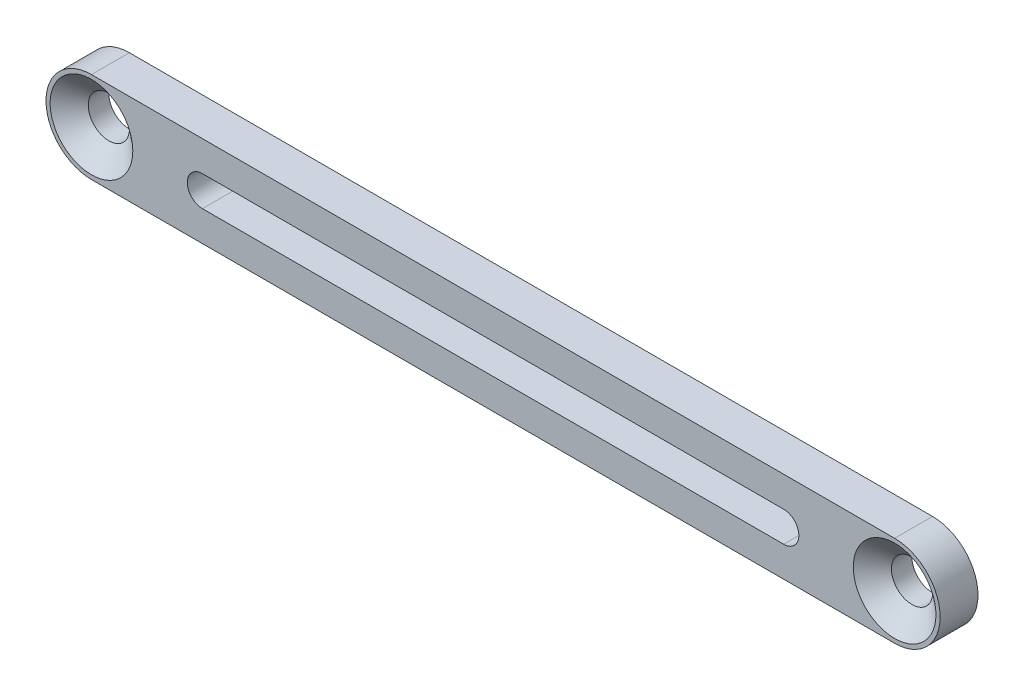
ISO-10303-21;
HEADER;
FILE_DESCRIPTION(('STEP AP214'),'2;1');
FILE_NAME('part.step','',(''),(''),'','','');
FILE_SCHEMA(('AUTOMOTIVE_DESIGN { 1 0 10303 214 1 1 1 1 }'));
ENDSEC;
DATA;
#1=APPLICATION_CONTEXT('core data for automotive mechanical design processes');
#2=APPLICATION_PROTOCOL_DEFINITION('international standard','automotive_design',2000,#1);
#3=PRODUCT_CONTEXT('',#1,'mechanical');
#4=PRODUCT('Part','Part','',(#3));
#5=PRODUCT_RELATED_PRODUCT_CATEGORY('part','',(#4));
#6=PRODUCT_DEFINITION_FORMATION('','',#4);
#7=PRODUCT_DEFINITION_CONTEXT('part definition',#1,'design');
#8=PRODUCT_DEFINITION('design','',#6,#7);
#9=PRODUCT_DEFINITION_SHAPE('','',#8);
#10=(LENGTH_UNIT() NAMED_UNIT(*) SI_UNIT(.MILLI.,.METRE.));
#11=(NAMED_UNIT(*) PLANE_ANGLE_UNIT() SI_UNIT($,.RADIAN.));
#12=(NAMED_UNIT(*) SI_UNIT($,.STERADIAN.) SOLID_ANGLE_UNIT());
#13=UNCERTAINTY_MEASURE_WITH_UNIT(LENGTH_MEASURE(1.E-05),#10,'distance_accuracy_value','');
#14=(GEOMETRIC_REPRESENTATION_CONTEXT(3) GLOBAL_UNCERTAINTY_ASSIGNED_CONTEXT((#13)) GLOBAL_UNIT_ASSIGNED_CONTEXT((#10,
#11,#12)) REPRESENTATION_CONTEXT('',''));
#15=CARTESIAN_POINT('',(0.,0.,0.));
#16=DIRECTION('',(0.,0.,1.));
#17=DIRECTION('',(1.,0.,0.));
#18=AXIS2_PLACEMENT_3D('',#15,#16,#17);
#19=CARTESIAN_POINT('',(5.46957111634242,20.4127173018017,3.175));
#20=DIRECTION('',(0.,0.,-1.));
#21=DIRECTION('',(-1.,0.,0.));
#22=AXIS2_PLACEMENT_3D('',#19,#20,#21);
#23=CYLINDRICAL_SURFACE('',#22,3.81);
#24=CARTESIAN_POINT('',(5.46957111634242,20.4127173018017,0.));
#25=DIRECTION('',(0.,0.,1.));
#26=DIRECTION('',(-1.,0.,0.));
#27=AXIS2_PLACEMENT_3D('',#24,#25,#26);
#28=CIRCLE('',#27,3.81);
#29=CARTESIAN_POINT('',(5.46957111634242,24.2227173018017,0.));
#30=VERTEX_POINT('',#29);
#31=CARTESIAN_POINT('',(5.46957111634242,16.6027173018017,0.));
#32=VERTEX_POINT('',#31);
#33=EDGE_CURVE('E150',#30,#32,#28,.T.);
#34=ORIENTED_EDGE('',*,*,#33,.T.);
#35=DIRECTION('',(0.,0.,-1.));
#36=VECTOR('',#35,1.);
#37=CARTESIAN_POINT('',(5.46957111634242,16.6027173018017,3.175));
#38=LINE('',#37,#36);
#39=CARTESIAN_POINT('',(5.46957111634242,16.6027173018017,3.175));
#40=VERTEX_POINT('',#39);
#41=EDGE_CURVE('E11',#40,#32,#38,.T.);
#42=ORIENTED_EDGE('',*,*,#41,.F.);
#43=CARTESIAN_POINT('',(5.46957111634242,20.4127173018017,3.175));
#44=DIRECTION('',(0.,0.,1.));
#45=DIRECTION('',(-1.,0.,0.));
#46=AXIS2_PLACEMENT_3D('',#43,#44,#45);
#47=CIRCLE('',#46,3.81);
#48=CARTESIAN_POINT('',(5.46957111634242,24.2227173018017,3.175));
#49=VERTEX_POINT('',#48);
#50=EDGE_CURVE('E151',#49,#40,#47,.T.);
#51=ORIENTED_EDGE('',*,*,#50,.F.);
#52=DIRECTION('',(0.,0.,-1.));
#53=VECTOR('',#52,1.);
#54=CARTESIAN_POINT('',(5.46957111634242,24.2227173018017,3.175));
#55=LINE('',#54,#53);
#56=EDGE_CURVE('E161',#49,#30,#55,.T.);
#57=ORIENTED_EDGE('',*,*,#56,.T.);
#58=EDGE_LOOP('',(#34,#42,#51,#57));
#59=FACE_BOUND('',#58,.T.);
#60=ADVANCED_FACE('F32',(#59),#23,.T.);
#61=CARTESIAN_POINT('',(5.46957111634242,16.6027173018017,3.175));
#62=DIRECTION('',(0.,1.,0.));
#63=DIRECTION('',(0.,0.,1.));
#64=AXIS2_PLACEMENT_3D('',#61,#62,#63);
#65=PLANE('',#64);
#66=DIRECTION('',(1.,0.,0.));
#67=VECTOR('',#66,1.);
#68=CARTESIAN_POINT('',(5.46957111634242,16.6027173018017,0.));
#69=LINE('',#68,#67);
#70=CARTESIAN_POINT('',(72.7691578096297,16.6027173018017,0.));
#71=VERTEX_POINT('',#70);
#72=EDGE_CURVE('E164',#32,#71,#69,.T.);
#73=ORIENTED_EDGE('',*,*,#72,.T.);
#74=DIRECTION('',(0.,0.,-1.));
#75=VECTOR('',#74,1.);
#76=CARTESIAN_POINT('',(72.7691578096297,16.6027173018017,3.175));
#77=LINE('',#76,#75);
#78=CARTESIAN_POINT('',(72.7691578096297,16.6027173018017,3.175));
#79=VERTEX_POINT('',#78);
#80=EDGE_CURVE('E39',#79,#71,#77,.T.);
#81=ORIENTED_EDGE('',*,*,#80,.F.);
#82=DIRECTION('',(1.,0.,0.));
#83=VECTOR('',#82,1.);
#84=CARTESIAN_POINT('',(5.46957111634242,16.6027173018017,3.175));
#85=LINE('',#84,#83);
#86=EDGE_CURVE('E154',#40,#79,#85,.T.);
#87=ORIENTED_EDGE('',*,*,#86,.F.);
#88=ORIENTED_EDGE('',*,*,#41,.T.);
#89=EDGE_LOOP('',(#73,#81,#87,#88));
#90=FACE_BOUND('',#89,.T.);
#91=ADVANCED_FACE('F193',(#90),#65,.F.);
#92=CARTESIAN_POINT('',(72.7691578096297,20.4127173018016,3.175));
#93=DIRECTION('',(0.,0.,-1.));
#94=DIRECTION('',(-1.,0.,0.));
#95=AXIS2_PLACEMENT_3D('',#92,#93,#94);
#96=CYLINDRICAL_SURFACE('',#95,3.81);
#97=CARTESIAN_POINT('',(72.7691578096297,20.4127173018016,0.));
#98=DIRECTION('',(0.,0.,1.));
#99=DIRECTION('',(1.,0.,0.));
#100=AXIS2_PLACEMENT_3D('',#97,#98,#99);
#101=CIRCLE('',#100,3.81);
#102=CARTESIAN_POINT('',(72.7691578096297,24.2227173018016,0.));
#103=VERTEX_POINT('',#102);
#104=EDGE_CURVE('E166',#71,#103,#101,.T.);
#105=ORIENTED_EDGE('',*,*,#104,.T.);
#106=DIRECTION('',(0.,0.,-1.));
#107=VECTOR('',#106,1.);
#108=CARTESIAN_POINT('',(72.7691578096297,24.2227173018016,3.175));
#109=LINE('',#108,#107);
#110=CARTESIAN_POINT('',(72.7691578096297,24.2227173018016,3.175));
#111=VERTEX_POINT('',#110);
#112=EDGE_CURVE('E171',#111,#103,#109,.T.);
#113=ORIENTED_EDGE('',*,*,#112,.F.);
#114=CARTESIAN_POINT('',(72.7691578096297,20.4127173018016,3.175));
#115=DIRECTION('',(0.,0.,1.));
#116=DIRECTION('',(1.,0.,0.));
#117=AXIS2_PLACEMENT_3D('',#114,#115,#116);
#118=CIRCLE('',#117,3.81);
#119=EDGE_CURVE('E157',#79,#111,#118,.T.);
#120=ORIENTED_EDGE('',*,*,#119,.F.);
#121=ORIENTED_EDGE('',*,*,#80,.T.);
#122=EDGE_LOOP('',(#105,#113,#120,#121));
#123=FACE_BOUND('',#122,.T.);
#124=ADVANCED_FACE('F178',(#123),#96,.T.);
#125=CARTESIAN_POINT('',(5.46957111634242,24.2227173018017,3.175));
#126=DIRECTION('',(0.,-1.,0.));
#127=DIRECTION('',(0.,0.,-1.));
#128=AXIS2_PLACEMENT_3D('',#125,#126,#127);
#129=PLANE('',#128);
#130=DIRECTION('',(-1.,0.,0.));
#131=VECTOR('',#130,1.);
#132=CARTESIAN_POINT('',(5.46957111634242,24.2227173018017,0.));
#133=LINE('',#132,#131);
#134=EDGE_CURVE('E155',#103,#30,#133,.T.);
#135=ORIENTED_EDGE('',*,*,#134,.T.);
#136=ORIENTED_EDGE('',*,*,#56,.F.);
#137=DIRECTION('',(-1.,0.,0.));
#138=VECTOR('',#137,1.);
#139=CARTESIAN_POINT('',(5.46957111634242,24.2227173018017,3.175));
#140=LINE('',#139,#138);
#141=EDGE_CURVE('E159',#111,#49,#140,.T.);
#142=ORIENTED_EDGE('',*,*,#141,.F.);
#143=ORIENTED_EDGE('',*,*,#112,.T.);
#144=EDGE_LOOP('',(#135,#136,#142,#143));
#145=FACE_BOUND('',#144,.T.);
#146=ADVANCED_FACE('F187',(#145),#129,.F.);
#147=CARTESIAN_POINT('',(5.46957111634242,20.4127173018017,3.175));
#148=DIRECTION('',(0.,0.,-1.));
#149=DIRECTION('',(-1.,0.,0.));
#150=AXIS2_PLACEMENT_3D('',#147,#148,#149);
#151=PLANE('',#150);
#152=DIRECTION('',(1.,0.,0.));
#153=VECTOR('',#152,1.);
#154=CARTESIAN_POINT('',(63.4727578096297,21.6827173018017,3.175));
#155=LINE('',#154,#153);
#156=CARTESIAN_POINT('',(14.7659711163424,21.6827173018017,3.175));
#157=VERTEX_POINT('',#156);
#158=CARTESIAN_POINT('',(63.4727578096297,21.6827173018017,3.175));
#159=VERTEX_POINT('',#158);
#160=EDGE_CURVE('E104',#157,#159,#155,.T.);
#161=ORIENTED_EDGE('',*,*,#160,.T.);
#162=CARTESIAN_POINT('',(63.4727578096297,20.4127173018016,3.175));
#163=DIRECTION('',(0.,0.,-1.));
#164=DIRECTION('',(-1.,0.,0.));
#165=AXIS2_PLACEMENT_3D('',#162,#163,#164);
#166=CIRCLE('',#165,1.27);
#167=CARTESIAN_POINT('',(63.4727578096297,19.1427173018017,3.175));
#168=VERTEX_POINT('',#167);
#169=EDGE_CURVE('E98',#159,#168,#166,.T.);
#170=ORIENTED_EDGE('',*,*,#169,.T.);
#171=DIRECTION('',(-1.,0.,0.));
#172=VECTOR('',#171,1.);
#173=CARTESIAN_POINT('',(63.4727578096297,19.1427173018017,3.175));
#174=LINE('',#173,#172);
#175=CARTESIAN_POINT('',(14.7659711163424,19.1427173018017,3.175));
#176=VERTEX_POINT('',#175);
#177=EDGE_CURVE('E107',#168,#176,#174,.T.);
#178=ORIENTED_EDGE('',*,*,#177,.T.);
#179=CARTESIAN_POINT('',(14.7659711163424,20.4127173018017,3.175));
#180=DIRECTION('',(0.,0.,-1.));
#181=DIRECTION('',(-1.,0.,0.));
#182=AXIS2_PLACEMENT_3D('',#179,#180,#181);
#183=CIRCLE('',#182,1.27);
#184=EDGE_CURVE('E46',#176,#157,#183,.T.);
#185=ORIENTED_EDGE('',*,*,#184,.T.);
#186=EDGE_LOOP('',(#161,#170,#178,#185));
#187=FACE_BOUND('',#186,.T.);
#188=CARTESIAN_POINT('',(5.46957111634242,20.4127173018017,3.175));
#189=DIRECTION('',(0.,0.,1.));
#190=DIRECTION('',(1.,0.,0.));
#191=AXIS2_PLACEMENT_3D('',#188,#189,#190);
#192=CIRCLE('',#191,3.462909);
#193=CARTESIAN_POINT('',(8.93248011634242,20.4127173018017,3.175));
#194=VERTEX_POINT('',#193);
#195=EDGE_CURVE('E129',#194,#194,#192,.T.);
#196=ORIENTED_EDGE('',*,*,#195,.F.);
#197=EDGE_LOOP('',(#196));
#198=FACE_BOUND('',#197,.T.);
#199=CARTESIAN_POINT('',(72.7691578096297,20.4127173018016,3.175));
#200=DIRECTION('',(0.,0.,1.));
#201=DIRECTION('',(1.,0.,0.));
#202=AXIS2_PLACEMENT_3D('',#199,#200,#201);
#203=CIRCLE('',#202,3.462909);
#204=CARTESIAN_POINT('',(76.2320668096297,20.4127173018016,3.175));
#205=VERTEX_POINT('',#204);
#206=EDGE_CURVE('E141',#205,#205,#203,.T.);
#207=ORIENTED_EDGE('',*,*,#206,.F.);
#208=EDGE_LOOP('',(#207));
#209=FACE_BOUND('',#208,.T.);
#210=ORIENTED_EDGE('',*,*,#50,.T.);
#211=ORIENTED_EDGE('',*,*,#86,.T.);
#212=ORIENTED_EDGE('',*,*,#119,.T.);
#213=ORIENTED_EDGE('',*,*,#141,.T.);
#214=EDGE_LOOP('',(#210,#211,#212,#213));
#215=FACE_BOUND('',#214,.T.);
#216=ADVANCED_FACE('F111',(#187,#198,#209,#215),#151,.F.);
#217=CARTESIAN_POINT('',(5.46957111634242,20.4127173018017,0.));
#218=DIRECTION('',(0.,0.,-1.));
#219=DIRECTION('',(-1.,0.,0.));
#220=AXIS2_PLACEMENT_3D('',#217,#218,#219);
#221=PLANE('',#220);
#222=CARTESIAN_POINT('',(63.4727578096297,20.4127173018016,0.));
#223=DIRECTION('',(0.,0.,-1.));
#224=DIRECTION('',(-1.,0.,0.));
#225=AXIS2_PLACEMENT_3D('',#222,#223,#224);
#226=CIRCLE('',#225,1.27);
#227=CARTESIAN_POINT('',(63.4727578096297,21.6827173018017,0.));
#228=VERTEX_POINT('',#227);
#229=CARTESIAN_POINT('',(63.4727578096297,19.1427173018017,0.));
#230=VERTEX_POINT('',#229);
#231=EDGE_CURVE('E54',#228,#230,#226,.T.);
#232=ORIENTED_EDGE('',*,*,#231,.F.);
#233=DIRECTION('',(1.,0.,0.));
#234=VECTOR('',#233,1.);
#235=CARTESIAN_POINT('',(63.4727578096297,21.6827173018017,0.));
#236=LINE('',#235,#234);
#237=CARTESIAN_POINT('',(14.7659711163424,21.6827173018017,0.));
#238=VERTEX_POINT('',#237);
#239=EDGE_CURVE('E114',#238,#228,#236,.T.);
#240=ORIENTED_EDGE('',*,*,#239,.F.);
#241=CARTESIAN_POINT('',(14.7659711163424,20.4127173018017,0.));
#242=DIRECTION('',(0.,0.,-1.));
#243=DIRECTION('',(-1.,0.,0.));
#244=AXIS2_PLACEMENT_3D('',#241,#242,#243);
#245=CIRCLE('',#244,1.27);
#246=CARTESIAN_POINT('',(14.7659711163424,19.1427173018017,0.));
#247=VERTEX_POINT('',#246);
#248=EDGE_CURVE('E117',#247,#238,#245,.T.);
#249=ORIENTED_EDGE('',*,*,#248,.F.);
#250=DIRECTION('',(-1.,0.,0.));
#251=VECTOR('',#250,1.);
#252=CARTESIAN_POINT('',(63.4727578096297,19.1427173018017,0.));
#253=LINE('',#252,#251);
#254=EDGE_CURVE('E123',#230,#247,#253,.T.);
#255=ORIENTED_EDGE('',*,*,#254,.F.);
#256=EDGE_LOOP('',(#232,#240,#249,#255));
#257=FACE_BOUND('',#256,.T.);
#258=CARTESIAN_POINT('',(5.46957111634242,20.4127173018017,0.));
#259=DIRECTION('',(0.,0.,1.));
#260=DIRECTION('',(1.,0.,0.));
#261=AXIS2_PLACEMENT_3D('',#258,#259,#260);
#262=CIRCLE('',#261,1.7272);
#263=CARTESIAN_POINT('',(7.19677111634242,20.4127173018017,0.));
#264=VERTEX_POINT('',#263);
#265=EDGE_CURVE('E138',#264,#264,#262,.T.);
#266=ORIENTED_EDGE('',*,*,#265,.T.);
#267=EDGE_LOOP('',(#266));
#268=FACE_BOUND('',#267,.T.);
#269=CARTESIAN_POINT('',(72.7691578096297,20.4127173018016,0.));
#270=DIRECTION('',(0.,0.,1.));
#271=DIRECTION('',(1.,0.,0.));
#272=AXIS2_PLACEMENT_3D('',#269,#270,#271);
#273=CIRCLE('',#272,1.7272);
#274=CARTESIAN_POINT('',(74.4963578096297,20.4127173018016,0.));
#275=VERTEX_POINT('',#274);
#276=EDGE_CURVE('E147',#275,#275,#273,.T.);
#277=ORIENTED_EDGE('',*,*,#276,.T.);
#278=EDGE_LOOP('',(#277));
#279=FACE_BOUND('',#278,.T.);
#280=ORIENTED_EDGE('',*,*,#33,.F.);
#281=ORIENTED_EDGE('',*,*,#134,.F.);
#282=ORIENTED_EDGE('',*,*,#104,.F.);
#283=ORIENTED_EDGE('',*,*,#72,.F.);
#284=EDGE_LOOP('',(#280,#281,#282,#283));
#285=FACE_BOUND('',#284,.T.);
#286=ADVANCED_FACE('F184',(#257,#268,#279,#285),#221,.T.);
#287=CARTESIAN_POINT('',(72.7691578096297,20.4127173018016,3.175));
#288=DIRECTION('',(0.,0.,1.));
#289=DIRECTION('',(1.,0.,0.));
#290=AXIS2_PLACEMENT_3D('',#287,#288,#289);
#291=CYLINDRICAL_SURFACE('',#290,1.7272);
#292=ORIENTED_EDGE('',*,*,#276,.F.);
#293=EDGE_LOOP('',(#292));
#294=FACE_BOUND('',#293,.T.);
#295=CARTESIAN_POINT('',(72.7691578096297,20.4127173018016,1.71856721826891));
#296=DIRECTION('',(0.,0.,1.));
#297=DIRECTION('',(1.,0.,0.));
#298=AXIS2_PLACEMENT_3D('',#295,#296,#297);
#299=CIRCLE('',#298,1.7272);
#300=CARTESIAN_POINT('',(74.4963578096297,20.4127173018016,1.71856721826891));
#301=VERTEX_POINT('',#300);
#302=EDGE_CURVE('E144',#301,#301,#299,.T.);
#303=ORIENTED_EDGE('',*,*,#302,.T.);
#304=EDGE_LOOP('',(#303));
#305=FACE_BOUND('',#304,.T.);
#306=ADVANCED_FACE('F205',(#294,#305),#291,.F.);
#307=CARTESIAN_POINT('',(72.7691578096297,20.4127173018016,3.175));
#308=DIRECTION('',(0.,0.,1.));
#309=DIRECTION('',(1.,0.,0.));
#310=AXIS2_PLACEMENT_3D('',#307,#308,#309);
#311=CONICAL_SURFACE('',#310,3.462909,0.872664625997165);
#312=ORIENTED_EDGE('',*,*,#302,.F.);
#313=EDGE_LOOP('',(#312));
#314=FACE_BOUND('',#313,.T.);
#315=ORIENTED_EDGE('',*,*,#206,.T.);
#316=EDGE_LOOP('',(#315));
#317=FACE_BOUND('',#316,.T.);
#318=ADVANCED_FACE('F211',(#314,#317),#311,.F.);
#319=CARTESIAN_POINT('',(5.46957111634242,20.4127173018017,3.175));
#320=DIRECTION('',(0.,0.,1.));
#321=DIRECTION('',(1.,0.,0.));
#322=AXIS2_PLACEMENT_3D('',#319,#320,#321);
#323=CYLINDRICAL_SURFACE('',#322,1.7272);
#324=ORIENTED_EDGE('',*,*,#265,.F.);
#325=EDGE_LOOP('',(#324));
#326=FACE_BOUND('',#325,.T.);
#327=CARTESIAN_POINT('',(5.46957111634242,20.4127173018017,1.71856721826891));
#328=DIRECTION('',(0.,0.,1.));
#329=DIRECTION('',(1.,0.,0.));
#330=AXIS2_PLACEMENT_3D('',#327,#328,#329);
#331=CIRCLE('',#330,1.7272);
#332=CARTESIAN_POINT('',(7.19677111634242,20.4127173018017,1.71856721826891));
#333=VERTEX_POINT('',#332);
#334=EDGE_CURVE('E135',#333,#333,#331,.T.);
#335=ORIENTED_EDGE('',*,*,#334,.T.);
#336=EDGE_LOOP('',(#335));
#337=FACE_BOUND('',#336,.T.);
#338=ADVANCED_FACE('F215',(#326,#337),#323,.F.);
#339=CARTESIAN_POINT('',(5.46957111634242,20.4127173018017,3.175));
#340=DIRECTION('',(0.,0.,1.));
#341=DIRECTION('',(1.,0.,0.));
#342=AXIS2_PLACEMENT_3D('',#339,#340,#341);
#343=CONICAL_SURFACE('',#342,3.462909,0.872664625997164);
#344=ORIENTED_EDGE('',*,*,#334,.F.);
#345=EDGE_LOOP('',(#344));
#346=FACE_BOUND('',#345,.T.);
#347=ORIENTED_EDGE('',*,*,#195,.T.);
#348=EDGE_LOOP('',(#347));
#349=FACE_BOUND('',#348,.T.);
#350=ADVANCED_FACE('F219',(#346,#349),#343,.F.);
#351=CARTESIAN_POINT('',(63.4727578096297,20.4127173018016,3.175));
#352=DIRECTION('',(0.,0.,-1.));
#353=DIRECTION('',(-1.,0.,0.));
#354=AXIS2_PLACEMENT_3D('',#351,#352,#353);
#355=CYLINDRICAL_SURFACE('',#354,1.27);
#356=ORIENTED_EDGE('',*,*,#231,.T.);
#357=DIRECTION('',(0.,0.,-1.));
#358=VECTOR('',#357,1.);
#359=CARTESIAN_POINT('',(63.4727578096297,19.1427173018017,3.175));
#360=LINE('',#359,#358);
#361=EDGE_CURVE('E94',#168,#230,#360,.T.);
#362=ORIENTED_EDGE('',*,*,#361,.F.);
#363=ORIENTED_EDGE('',*,*,#169,.F.);
#364=DIRECTION('',(0.,0.,-1.));
#365=VECTOR('',#364,1.);
#366=CARTESIAN_POINT('',(63.4727578096297,21.6827173018017,3.175));
#367=LINE('',#366,#365);
#368=EDGE_CURVE('E127',#159,#228,#367,.T.);
#369=ORIENTED_EDGE('',*,*,#368,.T.);
#370=EDGE_LOOP('',(#356,#362,#363,#369));
#371=FACE_BOUND('',#370,.T.);
#372=ADVANCED_FACE('F96',(#371),#355,.F.);
#373=CARTESIAN_POINT('',(63.4727578096297,21.6827173018017,3.175));
#374=DIRECTION('',(0.,1.,0.));
#375=DIRECTION('',(-1.,0.,0.));
#376=AXIS2_PLACEMENT_3D('',#373,#374,#375);
#377=PLANE('',#376);
#378=ORIENTED_EDGE('',*,*,#239,.T.);
#379=ORIENTED_EDGE('',*,*,#368,.F.);
#380=ORIENTED_EDGE('',*,*,#160,.F.);
#381=DIRECTION('',(0.,0.,-1.));
#382=VECTOR('',#381,1.);
#383=CARTESIAN_POINT('',(14.7659711163424,21.6827173018017,3.175));
#384=LINE('',#383,#382);
#385=EDGE_CURVE('E130',#157,#238,#384,.T.);
#386=ORIENTED_EDGE('',*,*,#385,.T.);
#387=EDGE_LOOP('',(#378,#379,#380,#386));
#388=FACE_BOUND('',#387,.T.);
#389=ADVANCED_FACE('F226',(#388),#377,.F.);
#390=CARTESIAN_POINT('',(14.7659711163424,20.4127173018017,3.175));
#391=DIRECTION('',(0.,0.,-1.));
#392=DIRECTION('',(-1.,0.,0.));
#393=AXIS2_PLACEMENT_3D('',#390,#391,#392);
#394=CYLINDRICAL_SURFACE('',#393,1.27);
#395=ORIENTED_EDGE('',*,*,#248,.T.);
#396=ORIENTED_EDGE('',*,*,#385,.F.);
#397=ORIENTED_EDGE('',*,*,#184,.F.);
#398=DIRECTION('',(0.,0.,-1.));
#399=VECTOR('',#398,1.);
#400=CARTESIAN_POINT('',(14.7659711163424,19.1427173018017,3.175));
#401=LINE('',#400,#399);
#402=EDGE_CURVE('E103',#176,#247,#401,.T.);
#403=ORIENTED_EDGE('',*,*,#402,.T.);
#404=EDGE_LOOP('',(#395,#396,#397,#403));
#405=FACE_BOUND('',#404,.T.);
#406=ADVANCED_FACE('F229',(#405),#394,.F.);
#407=CARTESIAN_POINT('',(63.4727578096297,19.1427173018017,3.175));
#408=DIRECTION('',(0.,-1.,0.));
#409=DIRECTION('',(1.,0.,0.));
#410=AXIS2_PLACEMENT_3D('',#407,#408,#409);
#411=PLANE('',#410);
#412=ORIENTED_EDGE('',*,*,#254,.T.);
#413=ORIENTED_EDGE('',*,*,#402,.F.);
#414=ORIENTED_EDGE('',*,*,#177,.F.);
#415=ORIENTED_EDGE('',*,*,#361,.T.);
#416=EDGE_LOOP('',(#412,#413,#414,#415));
#417=FACE_BOUND('',#416,.T.);
#418=ADVANCED_FACE('F108',(#417),#411,.F.);
#419=CLOSED_SHELL('',(#60,#91,#124,#146,#216,#286,#306,#318,#338,#350,#372,#389,#406,#418));
#420=MANIFOLD_SOLID_BREP('B2',#419);
#421=ADVANCED_BREP_SHAPE_REPRESENTATION('',(#18,#420),#14);
#422=SHAPE_DEFINITION_REPRESENTATION(#9,#421);
ENDSEC;
END-ISO-10303-21;
